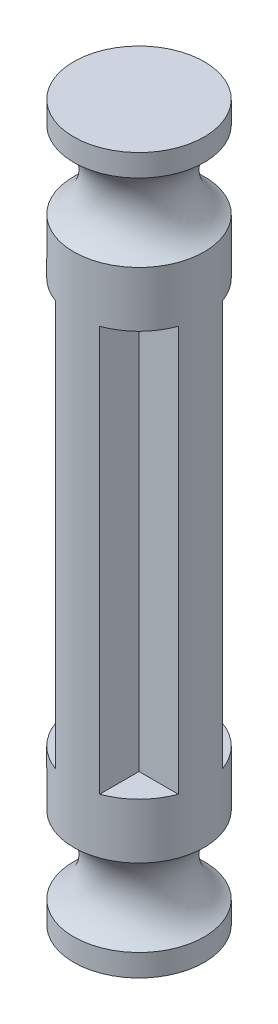
ISO-10303-21;
HEADER;
FILE_DESCRIPTION(('STEP AP214'),'2;1');
FILE_NAME('part.step','',(''),(''),'','','');
FILE_SCHEMA(('AUTOMOTIVE_DESIGN { 1 0 10303 214 1 1 1 1 }'));
ENDSEC;
DATA;
#1=APPLICATION_CONTEXT('core data for automotive mechanical design processes');
#2=APPLICATION_PROTOCOL_DEFINITION('international standard','automotive_design',2000,#1);
#3=PRODUCT_CONTEXT('',#1,'mechanical');
#4=PRODUCT('Part','Part','',(#3));
#5=PRODUCT_RELATED_PRODUCT_CATEGORY('part','',(#4));
#6=PRODUCT_DEFINITION_FORMATION('','',#4);
#7=PRODUCT_DEFINITION_CONTEXT('part definition',#1,'design');
#8=PRODUCT_DEFINITION('design','',#6,#7);
#9=PRODUCT_DEFINITION_SHAPE('','',#8);
#10=(LENGTH_UNIT() NAMED_UNIT(*) SI_UNIT(.MILLI.,.METRE.));
#11=(NAMED_UNIT(*) PLANE_ANGLE_UNIT() SI_UNIT($,.RADIAN.));
#12=(NAMED_UNIT(*) SI_UNIT($,.STERADIAN.) SOLID_ANGLE_UNIT());
#13=UNCERTAINTY_MEASURE_WITH_UNIT(LENGTH_MEASURE(1.E-05),#10,'distance_accuracy_value','');
#14=(GEOMETRIC_REPRESENTATION_CONTEXT(3) GLOBAL_UNCERTAINTY_ASSIGNED_CONTEXT((#13)) GLOBAL_UNIT_ASSIGNED_CONTEXT((#10,
#11,#12)) REPRESENTATION_CONTEXT('',''));
#15=CARTESIAN_POINT('',(0.,0.,0.));
#16=DIRECTION('',(0.,0.,1.));
#17=DIRECTION('',(1.,0.,0.));
#18=AXIS2_PLACEMENT_3D('',#15,#16,#17);
#19=CARTESIAN_POINT('',(1.,18.32,1.));
#20=DIRECTION('',(-1.,0.,0.));
#21=DIRECTION('',(0.,0.,1.));
#22=AXIS2_PLACEMENT_3D('',#19,#20,#21);
#23=PLANE('',#22);
#24=DIRECTION('',(0.,0.,-1.));
#25=VECTOR('',#24,1.);
#26=CARTESIAN_POINT('',(1.,0.,1.));
#27=LINE('',#26,#25);
#28=CARTESIAN_POINT('',(1.,0.,2.77533781727558));
#29=VERTEX_POINT('',#28);
#30=CARTESIAN_POINT('',(1.,0.,1.));
#31=VERTEX_POINT('',#30);
#32=EDGE_CURVE('E122',#29,#31,#27,.T.);
#33=ORIENTED_EDGE('',*,*,#32,.T.);
#34=DIRECTION('',(0.,-1.,0.));
#35=VECTOR('',#34,1.);
#36=CARTESIAN_POINT('',(1.,18.32,1.));
#37=LINE('',#36,#35);
#38=CARTESIAN_POINT('',(1.,18.32,1.));
#39=VERTEX_POINT('',#38);
#40=EDGE_CURVE('E11',#39,#31,#37,.T.);
#41=ORIENTED_EDGE('',*,*,#40,.F.);
#42=DIRECTION('',(0.,0.,-1.));
#43=VECTOR('',#42,1.);
#44=CARTESIAN_POINT('',(1.,18.32,1.));
#45=LINE('',#44,#43);
#46=CARTESIAN_POINT('',(0.999999999999999,18.32,2.77533781727558));
#47=VERTEX_POINT('',#46);
#48=EDGE_CURVE('E139',#47,#39,#45,.T.);
#49=ORIENTED_EDGE('',*,*,#48,.F.);
#50=DIRECTION('',(0.,-1.,0.));
#51=VECTOR('',#50,1.);
#52=CARTESIAN_POINT('',(0.999999999999999,18.32,2.77533781727558));
#53=LINE('',#52,#51);
#54=EDGE_CURVE('E52',#47,#29,#53,.T.);
#55=ORIENTED_EDGE('',*,*,#54,.T.);
#56=EDGE_LOOP('',(#33,#41,#49,#55));
#57=FACE_BOUND('',#56,.T.);
#58=ADVANCED_FACE('F37',(#57),#23,.F.);
#59=CARTESIAN_POINT('',(1.,18.32,1.));
#60=DIRECTION('',(0.,0.,-1.));
#61=DIRECTION('',(-1.,0.,0.));
#62=AXIS2_PLACEMENT_3D('',#59,#60,#61);
#63=PLANE('',#62);
#64=DIRECTION('',(1.,0.,0.));
#65=VECTOR('',#64,1.);
#66=CARTESIAN_POINT('',(1.,0.,1.));
#67=LINE('',#66,#65);
#68=CARTESIAN_POINT('',(2.77533781727558,0.,1.));
#69=VERTEX_POINT('',#68);
#70=EDGE_CURVE('E126',#31,#69,#67,.T.);
#71=ORIENTED_EDGE('',*,*,#70,.T.);
#72=DIRECTION('',(0.,-1.,0.));
#73=VECTOR('',#72,1.);
#74=CARTESIAN_POINT('',(2.77533781727558,18.32,1.));
#75=LINE('',#74,#73);
#76=CARTESIAN_POINT('',(2.77533781727558,18.32,1.));
#77=VERTEX_POINT('',#76);
#78=EDGE_CURVE('E45',#77,#69,#75,.T.);
#79=ORIENTED_EDGE('',*,*,#78,.F.);
#80=DIRECTION('',(1.,0.,0.));
#81=VECTOR('',#80,1.);
#82=CARTESIAN_POINT('',(1.,18.32,1.));
#83=LINE('',#82,#81);
#84=EDGE_CURVE('E213',#39,#77,#83,.T.);
#85=ORIENTED_EDGE('',*,*,#84,.F.);
#86=ORIENTED_EDGE('',*,*,#40,.T.);
#87=EDGE_LOOP('',(#71,#79,#85,#86));
#88=FACE_BOUND('',#87,.T.);
#89=ADVANCED_FACE('F277',(#88),#63,.F.);
#90=CARTESIAN_POINT('',(1.,18.32,-1.));
#91=DIRECTION('',(0.,0.,1.));
#92=DIRECTION('',(1.,0.,0.));
#93=AXIS2_PLACEMENT_3D('',#90,#91,#92);
#94=PLANE('',#93);
#95=DIRECTION('',(-1.,0.,0.));
#96=VECTOR('',#95,1.);
#97=CARTESIAN_POINT('',(1.,0.,-1.));
#98=LINE('',#97,#96);
#99=CARTESIAN_POINT('',(2.77533781727558,0.,-1.));
#100=VERTEX_POINT('',#99);
#101=CARTESIAN_POINT('',(1.,0.,-1.));
#102=VERTEX_POINT('',#101);
#103=EDGE_CURVE('E180',#100,#102,#98,.T.);
#104=ORIENTED_EDGE('',*,*,#103,.T.);
#105=DIRECTION('',(0.,-1.,0.));
#106=VECTOR('',#105,1.);
#107=CARTESIAN_POINT('',(1.,18.32,-1.));
#108=LINE('',#107,#106);
#109=CARTESIAN_POINT('',(1.,18.32,-1.));
#110=VERTEX_POINT('',#109);
#111=EDGE_CURVE('E171',#110,#102,#108,.T.);
#112=ORIENTED_EDGE('',*,*,#111,.F.);
#113=DIRECTION('',(-1.,0.,0.));
#114=VECTOR('',#113,1.);
#115=CARTESIAN_POINT('',(1.,18.32,-1.));
#116=LINE('',#115,#114);
#117=CARTESIAN_POINT('',(2.77533781727558,18.32,-1.));
#118=VERTEX_POINT('',#117);
#119=EDGE_CURVE('E182',#118,#110,#116,.T.);
#120=ORIENTED_EDGE('',*,*,#119,.F.);
#121=DIRECTION('',(0.,-1.,0.));
#122=VECTOR('',#121,1.);
#123=CARTESIAN_POINT('',(2.77533781727558,18.32,-1.));
#124=LINE('',#123,#122);
#125=EDGE_CURVE('E174',#118,#100,#124,.T.);
#126=ORIENTED_EDGE('',*,*,#125,.T.);
#127=EDGE_LOOP('',(#104,#112,#120,#126));
#128=FACE_BOUND('',#127,.T.);
#129=ADVANCED_FACE('F179',(#128),#94,.F.);
#130=CARTESIAN_POINT('',(1.,18.32,-1.));
#131=DIRECTION('',(-1.,0.,0.));
#132=DIRECTION('',(0.,0.,1.));
#133=AXIS2_PLACEMENT_3D('',#130,#131,#132);
#134=PLANE('',#133);
#135=DIRECTION('',(0.,0.,-1.));
#136=VECTOR('',#135,1.);
#137=CARTESIAN_POINT('',(1.,0.,-1.));
#138=LINE('',#137,#136);
#139=CARTESIAN_POINT('',(0.999999999999999,0.,-2.77533781727558));
#140=VERTEX_POINT('',#139);
#141=EDGE_CURVE('E230',#102,#140,#138,.T.);
#142=ORIENTED_EDGE('',*,*,#141,.T.);
#143=DIRECTION('',(0.,-1.,0.));
#144=VECTOR('',#143,1.);
#145=CARTESIAN_POINT('',(1.,18.32,-2.77533781727558));
#146=LINE('',#145,#144);
#147=CARTESIAN_POINT('',(1.,18.32,-2.77533781727558));
#148=VERTEX_POINT('',#147);
#149=EDGE_CURVE('E168',#148,#140,#146,.T.);
#150=ORIENTED_EDGE('',*,*,#149,.F.);
#151=DIRECTION('',(0.,0.,-1.));
#152=VECTOR('',#151,1.);
#153=CARTESIAN_POINT('',(1.,18.32,-1.));
#154=LINE('',#153,#152);
#155=EDGE_CURVE('E217',#110,#148,#154,.T.);
#156=ORIENTED_EDGE('',*,*,#155,.F.);
#157=ORIENTED_EDGE('',*,*,#111,.T.);
#158=EDGE_LOOP('',(#142,#150,#156,#157));
#159=FACE_BOUND('',#158,.T.);
#160=ADVANCED_FACE('F266',(#159),#134,.F.);
#161=CARTESIAN_POINT('',(-1.,18.32,-1.));
#162=DIRECTION('',(1.,0.,0.));
#163=DIRECTION('',(0.,0.,-1.));
#164=AXIS2_PLACEMENT_3D('',#161,#162,#163);
#165=PLANE('',#164);
#166=DIRECTION('',(0.,0.,1.));
#167=VECTOR('',#166,1.);
#168=CARTESIAN_POINT('',(-1.,0.,-1.));
#169=LINE('',#168,#167);
#170=CARTESIAN_POINT('',(-1.,0.,-2.77533781727558));
#171=VERTEX_POINT('',#170);
#172=CARTESIAN_POINT('',(-1.,0.,-1.));
#173=VERTEX_POINT('',#172);
#174=EDGE_CURVE('E232',#171,#173,#169,.T.);
#175=ORIENTED_EDGE('',*,*,#174,.T.);
#176=DIRECTION('',(0.,-1.,0.));
#177=VECTOR('',#176,1.);
#178=CARTESIAN_POINT('',(-1.,18.32,-1.));
#179=LINE('',#178,#177);
#180=CARTESIAN_POINT('',(-1.,18.32,-1.));
#181=VERTEX_POINT('',#180);
#182=EDGE_CURVE('E162',#181,#173,#179,.T.);
#183=ORIENTED_EDGE('',*,*,#182,.F.);
#184=DIRECTION('',(0.,0.,1.));
#185=VECTOR('',#184,1.);
#186=CARTESIAN_POINT('',(-1.,18.32,-1.));
#187=LINE('',#186,#185);
#188=CARTESIAN_POINT('',(-1.,18.32,-2.77533781727558));
#189=VERTEX_POINT('',#188);
#190=EDGE_CURVE('E220',#189,#181,#187,.T.);
#191=ORIENTED_EDGE('',*,*,#190,.F.);
#192=DIRECTION('',(0.,-1.,0.));
#193=VECTOR('',#192,1.);
#194=CARTESIAN_POINT('',(-1.,18.32,-2.77533781727558));
#195=LINE('',#194,#193);
#196=EDGE_CURVE('E165',#189,#171,#195,.T.);
#197=ORIENTED_EDGE('',*,*,#196,.T.);
#198=EDGE_LOOP('',(#175,#183,#191,#197));
#199=FACE_BOUND('',#198,.T.);
#200=ADVANCED_FACE('F264',(#199),#165,.F.);
#201=CARTESIAN_POINT('',(-1.,18.32,-1.));
#202=DIRECTION('',(0.,0.,1.));
#203=DIRECTION('',(1.,0.,0.));
#204=AXIS2_PLACEMENT_3D('',#201,#202,#203);
#205=PLANE('',#204);
#206=DIRECTION('',(-1.,0.,0.));
#207=VECTOR('',#206,1.);
#208=CARTESIAN_POINT('',(-1.,0.,-1.));
#209=LINE('',#208,#207);
#210=CARTESIAN_POINT('',(-2.77533781727558,0.,-1.));
#211=VERTEX_POINT('',#210);
#212=EDGE_CURVE('E235',#173,#211,#209,.T.);
#213=ORIENTED_EDGE('',*,*,#212,.T.);
#214=DIRECTION('',(0.,-1.,0.));
#215=VECTOR('',#214,1.);
#216=CARTESIAN_POINT('',(-2.77533781727558,18.32,-1.));
#217=LINE('',#216,#215);
#218=CARTESIAN_POINT('',(-2.77533781727558,18.32,-1.));
#219=VERTEX_POINT('',#218);
#220=EDGE_CURVE('E159',#219,#211,#217,.T.);
#221=ORIENTED_EDGE('',*,*,#220,.F.);
#222=DIRECTION('',(-1.,0.,0.));
#223=VECTOR('',#222,1.);
#224=CARTESIAN_POINT('',(-1.,18.32,-1.));
#225=LINE('',#224,#223);
#226=EDGE_CURVE('E223',#181,#219,#225,.T.);
#227=ORIENTED_EDGE('',*,*,#226,.F.);
#228=ORIENTED_EDGE('',*,*,#182,.T.);
#229=EDGE_LOOP('',(#213,#221,#227,#228));
#230=FACE_BOUND('',#229,.T.);
#231=ADVANCED_FACE('F260',(#230),#205,.F.);
#232=CARTESIAN_POINT('',(-1.,18.32,1.));
#233=DIRECTION('',(0.,0.,-1.));
#234=DIRECTION('',(-1.,0.,0.));
#235=AXIS2_PLACEMENT_3D('',#232,#233,#234);
#236=PLANE('',#235);
#237=DIRECTION('',(1.,0.,0.));
#238=VECTOR('',#237,1.);
#239=CARTESIAN_POINT('',(-1.,0.,1.));
#240=LINE('',#239,#238);
#241=CARTESIAN_POINT('',(-2.77533781727558,0.,1.));
#242=VERTEX_POINT('',#241);
#243=CARTESIAN_POINT('',(-1.,0.,1.));
#244=VERTEX_POINT('',#243);
#245=EDGE_CURVE('E237',#242,#244,#240,.T.);
#246=ORIENTED_EDGE('',*,*,#245,.T.);
#247=DIRECTION('',(0.,-1.,0.));
#248=VECTOR('',#247,1.);
#249=CARTESIAN_POINT('',(-1.,18.32,1.));
#250=LINE('',#249,#248);
#251=CARTESIAN_POINT('',(-1.,18.32,1.));
#252=VERTEX_POINT('',#251);
#253=EDGE_CURVE('E145',#252,#244,#250,.T.);
#254=ORIENTED_EDGE('',*,*,#253,.F.);
#255=DIRECTION('',(1.,0.,0.));
#256=VECTOR('',#255,1.);
#257=CARTESIAN_POINT('',(-1.,18.32,1.));
#258=LINE('',#257,#256);
#259=CARTESIAN_POINT('',(-2.77533781727558,18.32,0.999999999999999));
#260=VERTEX_POINT('',#259);
#261=EDGE_CURVE('E148',#260,#252,#258,.T.);
#262=ORIENTED_EDGE('',*,*,#261,.F.);
#263=DIRECTION('',(0.,-1.,0.));
#264=VECTOR('',#263,1.);
#265=CARTESIAN_POINT('',(-2.77533781727558,18.32,0.999999999999999));
#266=LINE('',#265,#264);
#267=EDGE_CURVE('E156',#260,#242,#266,.T.);
#268=ORIENTED_EDGE('',*,*,#267,.T.);
#269=EDGE_LOOP('',(#246,#254,#262,#268));
#270=FACE_BOUND('',#269,.T.);
#271=ADVANCED_FACE('F272',(#270),#236,.F.);
#272=CARTESIAN_POINT('',(-1.,18.32,1.));
#273=DIRECTION('',(1.,0.,0.));
#274=DIRECTION('',(0.,0.,-1.));
#275=AXIS2_PLACEMENT_3D('',#272,#273,#274);
#276=PLANE('',#275);
#277=DIRECTION('',(0.,0.,1.));
#278=VECTOR('',#277,1.);
#279=CARTESIAN_POINT('',(-1.,0.,1.));
#280=LINE('',#279,#278);
#281=CARTESIAN_POINT('',(-0.999999999999999,0.,2.77533781727558));
#282=VERTEX_POINT('',#281);
#283=EDGE_CURVE('E151',#244,#282,#280,.T.);
#284=ORIENTED_EDGE('',*,*,#283,.T.);
#285=DIRECTION('',(0.,-1.,0.));
#286=VECTOR('',#285,1.);
#287=CARTESIAN_POINT('',(-1.,18.32,2.77533781727558));
#288=LINE('',#287,#286);
#289=CARTESIAN_POINT('',(-0.999999999999999,18.32,2.77533781727559));
#290=VERTEX_POINT('',#289);
#291=EDGE_CURVE('E141',#290,#282,#288,.T.);
#292=ORIENTED_EDGE('',*,*,#291,.F.);
#293=DIRECTION('',(0.,0.,1.));
#294=VECTOR('',#293,1.);
#295=CARTESIAN_POINT('',(-1.,18.32,1.));
#296=LINE('',#295,#294);
#297=EDGE_CURVE('E142',#252,#290,#296,.T.);
#298=ORIENTED_EDGE('',*,*,#297,.F.);
#299=ORIENTED_EDGE('',*,*,#253,.T.);
#300=EDGE_LOOP('',(#284,#292,#298,#299));
#301=FACE_BOUND('',#300,.T.);
#302=ADVANCED_FACE('F242',(#301),#276,.F.);
#303=CARTESIAN_POINT('',(0.,18.32,0.));
#304=DIRECTION('',(0.,-1.,0.));
#305=DIRECTION('',(0.,0.,-1.));
#306=AXIS2_PLACEMENT_3D('',#303,#304,#305);
#307=CYLINDRICAL_SURFACE('',#306,2.95);
#308=CARTESIAN_POINT('',(0.,0.,0.));
#309=DIRECTION('',(0.,1.,0.));
#310=DIRECTION('',(0.,0.,1.));
#311=AXIS2_PLACEMENT_3D('',#308,#309,#310);
#312=CIRCLE('',#311,2.95);
#313=EDGE_CURVE('E124',#29,#69,#312,.T.);
#314=ORIENTED_EDGE('',*,*,#313,.F.);
#315=ORIENTED_EDGE('',*,*,#54,.F.);
#316=CARTESIAN_POINT('',(0.,18.32,0.));
#317=DIRECTION('',(0.,1.,0.));
#318=DIRECTION('',(0.,0.,1.));
#319=AXIS2_PLACEMENT_3D('',#316,#317,#318);
#320=CIRCLE('',#319,2.95);
#321=EDGE_CURVE('E129',#47,#77,#320,.T.);
#322=ORIENTED_EDGE('',*,*,#321,.T.);
#323=ORIENTED_EDGE('',*,*,#78,.T.);
#324=EDGE_LOOP('',(#314,#315,#322,#323));
#325=FACE_BOUND('',#324,.T.);
#326=EDGE_CURVE('E137',#242,#282,#312,.T.);
#327=ORIENTED_EDGE('',*,*,#326,.F.);
#328=ORIENTED_EDGE('',*,*,#267,.F.);
#329=EDGE_CURVE('E210',#260,#290,#320,.T.);
#330=ORIENTED_EDGE('',*,*,#329,.T.);
#331=ORIENTED_EDGE('',*,*,#291,.T.);
#332=EDGE_LOOP('',(#327,#328,#330,#331));
#333=FACE_BOUND('',#332,.T.);
#334=EDGE_CURVE('E191',#171,#211,#312,.T.);
#335=ORIENTED_EDGE('',*,*,#334,.F.);
#336=ORIENTED_EDGE('',*,*,#196,.F.);
#337=EDGE_CURVE('E251',#189,#219,#320,.T.);
#338=ORIENTED_EDGE('',*,*,#337,.T.);
#339=ORIENTED_EDGE('',*,*,#220,.T.);
#340=EDGE_LOOP('',(#335,#336,#338,#339));
#341=FACE_BOUND('',#340,.T.);
#342=ORIENTED_EDGE('',*,*,#149,.T.);
#343=EDGE_CURVE('E135',#100,#140,#312,.T.);
#344=ORIENTED_EDGE('',*,*,#343,.F.);
#345=ORIENTED_EDGE('',*,*,#125,.F.);
#346=EDGE_CURVE('E188',#118,#148,#320,.T.);
#347=ORIENTED_EDGE('',*,*,#346,.T.);
#348=EDGE_LOOP('',(#342,#344,#345,#347));
#349=FACE_BOUND('',#348,.T.);
#350=CARTESIAN_POINT('',(0.,20.82,0.));
#351=DIRECTION('',(0.,1.,0.));
#352=DIRECTION('',(0.,0.,1.));
#353=AXIS2_PLACEMENT_3D('',#350,#351,#352);
#354=CIRCLE('',#353,2.95);
#355=CARTESIAN_POINT('',(0.,20.82,2.95000000000001));
#356=VERTEX_POINT('',#355);
#357=EDGE_CURVE('E207',#356,#356,#354,.T.);
#358=ORIENTED_EDGE('',*,*,#357,.F.);
#359=EDGE_LOOP('',(#358));
#360=FACE_BOUND('',#359,.T.);
#361=CARTESIAN_POINT('',(0.,-2.5,0.));
#362=DIRECTION('',(0.,1.,0.));
#363=DIRECTION('',(0.,0.,1.));
#364=AXIS2_PLACEMENT_3D('',#361,#362,#363);
#365=CIRCLE('',#364,2.95);
#366=CARTESIAN_POINT('',(0.,-2.5,2.95));
#367=VERTEX_POINT('',#366);
#368=EDGE_CURVE('E134',#367,#367,#365,.T.);
#369=ORIENTED_EDGE('',*,*,#368,.T.);
#370=EDGE_LOOP('',(#369));
#371=FACE_BOUND('',#370,.T.);
#372=ADVANCED_FACE('F132',(#325,#333,#341,#349,#360,#371),#307,.T.);
#373=CARTESIAN_POINT('',(0.,18.32,0.));
#374=DIRECTION('',(0.,1.,0.));
#375=DIRECTION('',(0.,0.,1.));
#376=AXIS2_PLACEMENT_3D('',#373,#374,#375);
#377=PLANE('',#376);
#378=ORIENTED_EDGE('',*,*,#321,.F.);
#379=ORIENTED_EDGE('',*,*,#48,.T.);
#380=ORIENTED_EDGE('',*,*,#84,.T.);
#381=EDGE_LOOP('',(#378,#379,#380));
#382=FACE_BOUND('',#381,.T.);
#383=ADVANCED_FACE('F287',(#382),#377,.F.);
#384=ORIENTED_EDGE('',*,*,#346,.F.);
#385=ORIENTED_EDGE('',*,*,#119,.T.);
#386=ORIENTED_EDGE('',*,*,#155,.T.);
#387=EDGE_LOOP('',(#384,#385,#386));
#388=FACE_BOUND('',#387,.T.);
#389=ADVANCED_FACE('F289',(#388),#377,.F.);
#390=ORIENTED_EDGE('',*,*,#337,.F.);
#391=ORIENTED_EDGE('',*,*,#190,.T.);
#392=ORIENTED_EDGE('',*,*,#226,.T.);
#393=EDGE_LOOP('',(#390,#391,#392));
#394=FACE_BOUND('',#393,.T.);
#395=ADVANCED_FACE('F257',(#394),#377,.F.);
#396=ORIENTED_EDGE('',*,*,#329,.F.);
#397=ORIENTED_EDGE('',*,*,#261,.T.);
#398=ORIENTED_EDGE('',*,*,#297,.T.);
#399=EDGE_LOOP('',(#396,#397,#398));
#400=FACE_BOUND('',#399,.T.);
#401=ADVANCED_FACE('F291',(#400),#377,.F.);
#402=CARTESIAN_POINT('',(0.,22.57,0.));
#403=DIRECTION('',(0.,1.,0.));
#404=DIRECTION('',(0.,0.,1.));
#405=AXIS2_PLACEMENT_3D('',#402,#403,#404);
#406=TOROIDAL_SURFACE('',#405,3.91824583655186,2.);
#407=CARTESIAN_POINT('',(0.,24.32,0.));
#408=DIRECTION('',(0.,1.,0.));
#409=DIRECTION('',(0.,0.,1.));
#410=AXIS2_PLACEMENT_3D('',#407,#408,#409);
#411=CIRCLE('',#410,2.95);
#412=CARTESIAN_POINT('',(0.,24.32,2.95000000000001));
#413=VERTEX_POINT('',#412);
#414=EDGE_CURVE('E204',#413,#413,#411,.T.);
#415=ORIENTED_EDGE('',*,*,#414,.F.);
#416=EDGE_LOOP('',(#415));
#417=FACE_BOUND('',#416,.T.);
#418=ORIENTED_EDGE('',*,*,#357,.T.);
#419=EDGE_LOOP('',(#418));
#420=FACE_BOUND('',#419,.T.);
#421=ADVANCED_FACE('F300',(#417,#420),#406,.F.);
#422=CARTESIAN_POINT('',(0.,0.,0.));
#423=DIRECTION('',(0.,1.,0.));
#424=DIRECTION('',(0.,0.,1.));
#425=AXIS2_PLACEMENT_3D('',#422,#423,#424);
#426=CYLINDRICAL_SURFACE('',#425,2.95);
#427=CARTESIAN_POINT('',(0.,25.32,0.));
#428=DIRECTION('',(0.,1.,0.));
#429=DIRECTION('',(0.,0.,1.));
#430=AXIS2_PLACEMENT_3D('',#427,#428,#429);
#431=CIRCLE('',#430,2.95);
#432=CARTESIAN_POINT('',(0.,25.32,2.95000000000001));
#433=VERTEX_POINT('',#432);
#434=EDGE_CURVE('E201',#433,#433,#431,.T.);
#435=ORIENTED_EDGE('',*,*,#434,.F.);
#436=EDGE_LOOP('',(#435));
#437=FACE_BOUND('',#436,.T.);
#438=ORIENTED_EDGE('',*,*,#414,.T.);
#439=EDGE_LOOP('',(#438));
#440=FACE_BOUND('',#439,.T.);
#441=ADVANCED_FACE('F305',(#437,#440),#426,.T.);
#442=CARTESIAN_POINT('',(0.,25.32,0.));
#443=DIRECTION('',(0.,-1.,0.));
#444=DIRECTION('',(0.,0.,-1.));
#445=AXIS2_PLACEMENT_3D('',#442,#443,#444);
#446=PLANE('',#445);
#447=ORIENTED_EDGE('',*,*,#434,.T.);
#448=EDGE_LOOP('',(#447));
#449=FACE_BOUND('',#448,.T.);
#450=ADVANCED_FACE('F405',(#449),#446,.F.);
#451=CARTESIAN_POINT('',(0.,0.,0.));
#452=DIRECTION('',(0.,-1.,0.));
#453=DIRECTION('',(0.,0.,-1.));
#454=AXIS2_PLACEMENT_3D('',#451,#452,#453);
#455=PLANE('',#454);
#456=ORIENTED_EDGE('',*,*,#283,.F.);
#457=ORIENTED_EDGE('',*,*,#245,.F.);
#458=ORIENTED_EDGE('',*,*,#326,.T.);
#459=EDGE_LOOP('',(#456,#457,#458));
#460=FACE_BOUND('',#459,.T.);
#461=ADVANCED_FACE('F414',(#460),#455,.F.);
#462=ORIENTED_EDGE('',*,*,#212,.F.);
#463=ORIENTED_EDGE('',*,*,#174,.F.);
#464=ORIENTED_EDGE('',*,*,#334,.T.);
#465=EDGE_LOOP('',(#462,#463,#464));
#466=FACE_BOUND('',#465,.T.);
#467=ADVANCED_FACE('F262',(#466),#455,.F.);
#468=ORIENTED_EDGE('',*,*,#141,.F.);
#469=ORIENTED_EDGE('',*,*,#103,.F.);
#470=ORIENTED_EDGE('',*,*,#343,.T.);
#471=EDGE_LOOP('',(#468,#469,#470));
#472=FACE_BOUND('',#471,.T.);
#473=ADVANCED_FACE('F430',(#472),#455,.F.);
#474=ORIENTED_EDGE('',*,*,#32,.F.);
#475=ORIENTED_EDGE('',*,*,#313,.T.);
#476=ORIENTED_EDGE('',*,*,#70,.F.);
#477=EDGE_LOOP('',(#474,#475,#476));
#478=FACE_BOUND('',#477,.T.);
#479=ADVANCED_FACE('F123',(#478),#455,.F.);
#480=CARTESIAN_POINT('',(0.,-7.,0.));
#481=DIRECTION('',(0.,1.,0.));
#482=DIRECTION('',(0.,0.,1.));
#483=AXIS2_PLACEMENT_3D('',#480,#481,#482);
#484=PLANE('',#483);
#485=CARTESIAN_POINT('',(0.,-7.,0.));
#486=DIRECTION('',(0.,1.,0.));
#487=DIRECTION('',(0.,0.,1.));
#488=AXIS2_PLACEMENT_3D('',#485,#486,#487);
#489=CIRCLE('',#488,2.95);
#490=CARTESIAN_POINT('',(0.,-7.,2.95));
#491=VERTEX_POINT('',#490);
#492=EDGE_CURVE('E198',#491,#491,#489,.T.);
#493=ORIENTED_EDGE('',*,*,#492,.F.);
#494=EDGE_LOOP('',(#493));
#495=FACE_BOUND('',#494,.T.);
#496=ADVANCED_FACE('F443',(#495),#484,.F.);
#497=CARTESIAN_POINT('',(0.,0.,0.));
#498=DIRECTION('',(0.,1.,0.));
#499=DIRECTION('',(0.,0.,1.));
#500=AXIS2_PLACEMENT_3D('',#497,#498,#499);
#501=CYLINDRICAL_SURFACE('',#500,2.95);
#502=CARTESIAN_POINT('',(0.,-6.,0.));
#503=DIRECTION('',(0.,1.,0.));
#504=DIRECTION('',(0.,0.,1.));
#505=AXIS2_PLACEMENT_3D('',#502,#503,#504);
#506=CIRCLE('',#505,2.95);
#507=CARTESIAN_POINT('',(0.,-6.,2.95));
#508=VERTEX_POINT('',#507);
#509=EDGE_CURVE('E195',#508,#508,#506,.T.);
#510=ORIENTED_EDGE('',*,*,#509,.F.);
#511=EDGE_LOOP('',(#510));
#512=FACE_BOUND('',#511,.T.);
#513=ORIENTED_EDGE('',*,*,#492,.T.);
#514=EDGE_LOOP('',(#513));
#515=FACE_BOUND('',#514,.T.);
#516=ADVANCED_FACE('F450',(#512,#515),#501,.T.);
#517=CARTESIAN_POINT('',(0.,-4.25,0.));
#518=DIRECTION('',(0.,1.,0.));
#519=DIRECTION('',(0.,0.,1.));
#520=AXIS2_PLACEMENT_3D('',#517,#518,#519);
#521=TOROIDAL_SURFACE('',#520,3.91824583655185,2.);
#522=ORIENTED_EDGE('',*,*,#368,.F.);
#523=EDGE_LOOP('',(#522));
#524=FACE_BOUND('',#523,.T.);
#525=ORIENTED_EDGE('',*,*,#509,.T.);
#526=EDGE_LOOP('',(#525));
#527=FACE_BOUND('',#526,.T.);
#528=ADVANCED_FACE('F459',(#524,#527),#521,.F.);
#529=CLOSED_SHELL('',(#58,#89,#129,#160,#200,#231,#271,#302,#372,#383,#389,#395,#401,#421,#441,
#450,#461,#467,#473,#479,#496,#516,#528));
#530=MANIFOLD_SOLID_BREP('B2',#529);
#531=ADVANCED_BREP_SHAPE_REPRESENTATION('',(#18,#530),#14);
#532=SHAPE_DEFINITION_REPRESENTATION(#9,#531);
ENDSEC;
END-ISO-10303-21;
